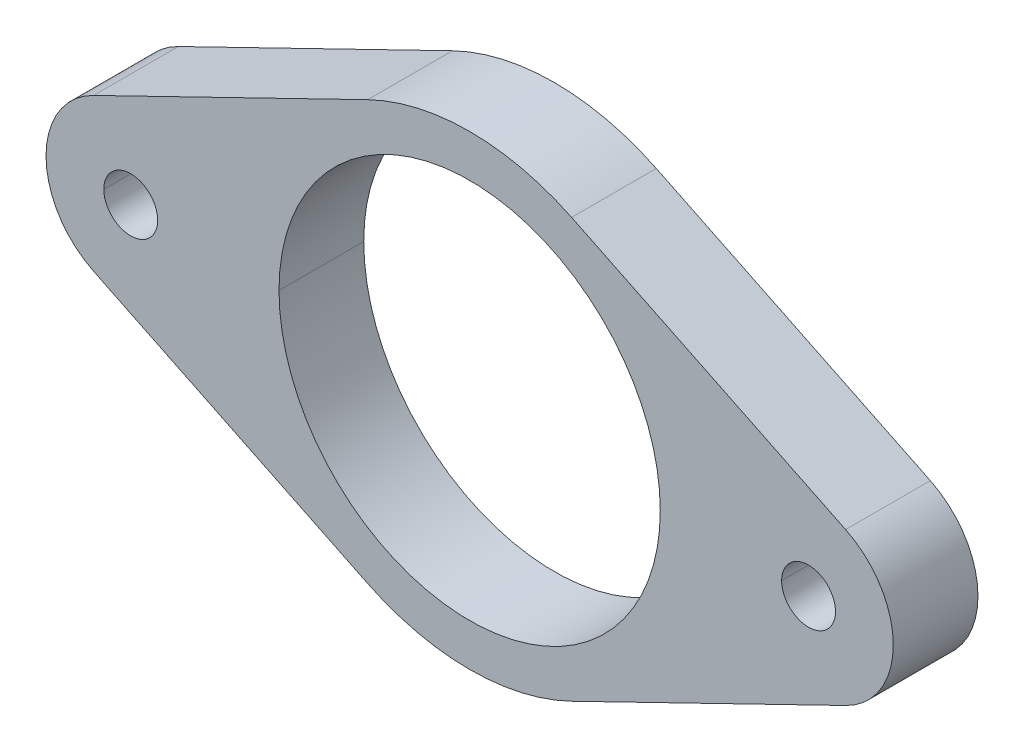
ISO-10303-21;
HEADER;
FILE_DESCRIPTION(('STEP AP214'),'2;1');
FILE_NAME('part.step','',(''),(''),'','','');
FILE_SCHEMA(('AUTOMOTIVE_DESIGN { 1 0 10303 214 1 1 1 1 }'));
ENDSEC;
DATA;
#1=APPLICATION_CONTEXT('core data for automotive mechanical design processes');
#2=APPLICATION_PROTOCOL_DEFINITION('international standard','automotive_design',2000,#1);
#3=PRODUCT_CONTEXT('',#1,'mechanical');
#4=PRODUCT('Part','Part','',(#3));
#5=PRODUCT_RELATED_PRODUCT_CATEGORY('part','',(#4));
#6=PRODUCT_DEFINITION_FORMATION('','',#4);
#7=PRODUCT_DEFINITION_CONTEXT('part definition',#1,'design');
#8=PRODUCT_DEFINITION('design','',#6,#7);
#9=PRODUCT_DEFINITION_SHAPE('','',#8);
#10=(LENGTH_UNIT() NAMED_UNIT(*) SI_UNIT(.MILLI.,.METRE.));
#11=(NAMED_UNIT(*) PLANE_ANGLE_UNIT() SI_UNIT($,.RADIAN.));
#12=(NAMED_UNIT(*) SI_UNIT($,.STERADIAN.) SOLID_ANGLE_UNIT());
#13=UNCERTAINTY_MEASURE_WITH_UNIT(LENGTH_MEASURE(1.E-05),#10,'distance_accuracy_value','');
#14=(GEOMETRIC_REPRESENTATION_CONTEXT(3) GLOBAL_UNCERTAINTY_ASSIGNED_CONTEXT((#13)) GLOBAL_UNIT_ASSIGNED_CONTEXT((#10,
#11,#12)) REPRESENTATION_CONTEXT('',''));
#15=CARTESIAN_POINT('',(0.,0.,0.));
#16=DIRECTION('',(0.,0.,1.));
#17=DIRECTION('',(1.,0.,0.));
#18=AXIS2_PLACEMENT_3D('',#15,#16,#17);
#19=CARTESIAN_POINT('',(-25.4,0.,3.175));
#20=DIRECTION('',(0.,0.,1.));
#21=DIRECTION('',(1.,0.,0.));
#22=AXIS2_PLACEMENT_3D('',#19,#20,#21);
#23=CYLINDRICAL_SURFACE('',#22,2.0193);
#24=DIRECTION('',(0.,0.,1.));
#25=VECTOR('',#24,1.);
#26=CARTESIAN_POINT('',(-27.4193,0.,3.175));
#27=LINE('',#26,#25);
#28=CARTESIAN_POINT('',(-27.4193,0.,-3.175));
#29=VERTEX_POINT('',#28);
#30=CARTESIAN_POINT('',(-27.4193,0.,3.175));
#31=VERTEX_POINT('',#30);
#32=EDGE_CURVE('E269',#29,#31,#27,.T.);
#33=ORIENTED_EDGE('',*,*,#32,.F.);
#34=CARTESIAN_POINT('',(-25.4,0.,-3.175));
#35=DIRECTION('',(0.,0.,1.));
#36=DIRECTION('',(1.,0.,0.));
#37=AXIS2_PLACEMENT_3D('',#34,#35,#36);
#38=CIRCLE('',#37,2.0193);
#39=CARTESIAN_POINT('',(-23.3807,0.,-3.175));
#40=VERTEX_POINT('',#39);
#41=EDGE_CURVE('E28',#40,#29,#38,.T.);
#42=ORIENTED_EDGE('',*,*,#41,.F.);
#43=DIRECTION('',(0.,0.,1.));
#44=VECTOR('',#43,1.);
#45=CARTESIAN_POINT('',(-23.3807,0.,3.175));
#46=LINE('',#45,#44);
#47=CARTESIAN_POINT('',(-23.3807,0.,3.175));
#48=VERTEX_POINT('',#47);
#49=EDGE_CURVE('E264',#40,#48,#46,.T.);
#50=ORIENTED_EDGE('',*,*,#49,.T.);
#51=CARTESIAN_POINT('',(-25.4,0.,3.175));
#52=DIRECTION('',(0.,0.,1.));
#53=DIRECTION('',(1.,0.,0.));
#54=AXIS2_PLACEMENT_3D('',#51,#52,#53);
#55=CIRCLE('',#54,2.0193);
#56=EDGE_CURVE('E245',#48,#31,#55,.T.);
#57=ORIENTED_EDGE('',*,*,#56,.T.);
#58=EDGE_LOOP('',(#33,#42,#50,#57));
#59=FACE_BOUND('',#58,.T.);
#60=ADVANCED_FACE('F17',(#59),#23,.F.);
#61=CARTESIAN_POINT('',(25.4,0.,3.175));
#62=DIRECTION('',(0.,0.,1.));
#63=DIRECTION('',(1.,0.,0.));
#64=AXIS2_PLACEMENT_3D('',#61,#62,#63);
#65=CYLINDRICAL_SURFACE('',#64,2.0193);
#66=DIRECTION('',(0.,0.,1.));
#67=VECTOR('',#66,1.);
#68=CARTESIAN_POINT('',(23.3807,0.,3.175));
#69=LINE('',#68,#67);
#70=CARTESIAN_POINT('',(23.3807,0.,-3.175));
#71=VERTEX_POINT('',#70);
#72=CARTESIAN_POINT('',(23.3807,0.,3.175));
#73=VERTEX_POINT('',#72);
#74=EDGE_CURVE('E263',#71,#73,#69,.T.);
#75=ORIENTED_EDGE('',*,*,#74,.F.);
#76=CARTESIAN_POINT('',(25.4,0.,-3.175));
#77=DIRECTION('',(0.,0.,1.));
#78=DIRECTION('',(1.,0.,0.));
#79=AXIS2_PLACEMENT_3D('',#76,#77,#78);
#80=CIRCLE('',#79,2.0193);
#81=CARTESIAN_POINT('',(27.4193,0.,-3.175));
#82=VERTEX_POINT('',#81);
#83=EDGE_CURVE('E11',#82,#71,#80,.T.);
#84=ORIENTED_EDGE('',*,*,#83,.F.);
#85=DIRECTION('',(0.,0.,1.));
#86=VECTOR('',#85,1.);
#87=CARTESIAN_POINT('',(27.4193,0.,3.175));
#88=LINE('',#87,#86);
#89=CARTESIAN_POINT('',(27.4193,0.,3.175));
#90=VERTEX_POINT('',#89);
#91=EDGE_CURVE('E21',#82,#90,#88,.T.);
#92=ORIENTED_EDGE('',*,*,#91,.T.);
#93=CARTESIAN_POINT('',(25.4,0.,3.175));
#94=DIRECTION('',(0.,0.,1.));
#95=DIRECTION('',(1.,0.,0.));
#96=AXIS2_PLACEMENT_3D('',#93,#94,#95);
#97=CIRCLE('',#96,2.0193);
#98=EDGE_CURVE('E289',#90,#73,#97,.T.);
#99=ORIENTED_EDGE('',*,*,#98,.T.);
#100=EDGE_LOOP('',(#75,#84,#92,#99));
#101=FACE_BOUND('',#100,.T.);
#102=ADVANCED_FACE('F390',(#101),#65,.F.);
#103=CARTESIAN_POINT('',(0.,0.,-3.175));
#104=DIRECTION('',(0.,0.,1.));
#105=DIRECTION('',(1.,0.,0.));
#106=AXIS2_PLACEMENT_3D('',#103,#104,#105);
#107=PLANE('',#106);
#108=CARTESIAN_POINT('',(0.,0.,-3.175));
#109=DIRECTION('',(0.,0.,1.));
#110=DIRECTION('',(1.,0.,0.));
#111=AXIS2_PLACEMENT_3D('',#108,#109,#110);
#112=CIRCLE('',#111,14.2875);
#113=CARTESIAN_POINT('',(-14.2875,0.,-3.175));
#114=VERTEX_POINT('',#113);
#115=CARTESIAN_POINT('',(14.2875,0.,-3.175));
#116=VERTEX_POINT('',#115);
#117=EDGE_CURVE('E194',#114,#116,#112,.T.);
#118=ORIENTED_EDGE('',*,*,#117,.T.);
#119=CARTESIAN_POINT('',(0.,0.,-3.175));
#120=DIRECTION('',(0.,0.,1.));
#121=DIRECTION('',(1.,0.,0.));
#122=AXIS2_PLACEMENT_3D('',#119,#120,#121);
#123=CIRCLE('',#122,14.2875);
#124=EDGE_CURVE('E180',#116,#114,#123,.T.);
#125=ORIENTED_EDGE('',*,*,#124,.T.);
#126=EDGE_LOOP('',(#118,#125));
#127=FACE_BOUND('',#126,.T.);
#128=ORIENTED_EDGE('',*,*,#83,.T.);
#129=CARTESIAN_POINT('',(25.4,0.,-3.175));
#130=DIRECTION('',(0.,0.,1.));
#131=DIRECTION('',(1.,0.,0.));
#132=AXIS2_PLACEMENT_3D('',#129,#130,#131);
#133=CIRCLE('',#132,2.0193);
#134=EDGE_CURVE('E259',#71,#82,#133,.T.);
#135=ORIENTED_EDGE('',*,*,#134,.T.);
#136=EDGE_LOOP('',(#128,#135));
#137=FACE_BOUND('',#136,.T.);
#138=ORIENTED_EDGE('',*,*,#41,.T.);
#139=CARTESIAN_POINT('',(-25.4,0.,-3.175));
#140=DIRECTION('',(0.,0.,1.));
#141=DIRECTION('',(1.,0.,0.));
#142=AXIS2_PLACEMENT_3D('',#139,#140,#141);
#143=CIRCLE('',#142,2.0193);
#144=EDGE_CURVE('E212',#29,#40,#143,.T.);
#145=ORIENTED_EDGE('',*,*,#144,.T.);
#146=EDGE_LOOP('',(#138,#145));
#147=FACE_BOUND('',#146,.T.);
#148=DIRECTION('',(-0.899218410621135,0.4375,0.));
#149=VECTOR('',#148,1.);
#150=CARTESIAN_POINT('',(7.63984375,15.7026014954715,-3.175));
#151=LINE('',#150,#149);
#152=CARTESIAN_POINT('',(28.178125,5.71003690744421,-3.175));
#153=VERTEX_POINT('',#152);
#154=CARTESIAN_POINT('',(7.63984375,15.7026014954715,-3.175));
#155=VERTEX_POINT('',#154);
#156=EDGE_CURVE('E290',#153,#155,#151,.T.);
#157=ORIENTED_EDGE('',*,*,#156,.F.);
#158=CARTESIAN_POINT('',(25.4,0.,-3.175));
#159=DIRECTION('',(0.,0.,1.));
#160=DIRECTION('',(1.,0.,0.));
#161=AXIS2_PLACEMENT_3D('',#158,#159,#160);
#162=CIRCLE('',#161,6.35);
#163=CARTESIAN_POINT('',(28.178125,-5.71003690744421,-3.175));
#164=VERTEX_POINT('',#163);
#165=EDGE_CURVE('E191',#164,#153,#162,.T.);
#166=ORIENTED_EDGE('',*,*,#165,.F.);
#167=DIRECTION('',(-0.899218410621135,-0.4375,0.));
#168=VECTOR('',#167,1.);
#169=CARTESIAN_POINT('',(7.63984375,-15.7026014954715,-3.175));
#170=LINE('',#169,#168);
#171=CARTESIAN_POINT('',(7.63984375,-15.7026014954715,-3.175));
#172=VERTEX_POINT('',#171);
#173=EDGE_CURVE('E355',#164,#172,#170,.T.);
#174=ORIENTED_EDGE('',*,*,#173,.T.);
#175=CARTESIAN_POINT('',(0.,0.,-3.175));
#176=DIRECTION('',(0.,0.,1.));
#177=DIRECTION('',(1.,0.,0.));
#178=AXIS2_PLACEMENT_3D('',#175,#176,#177);
#179=CIRCLE('',#178,17.4625);
#180=CARTESIAN_POINT('',(-7.63984375,-15.7026014954715,-3.175));
#181=VERTEX_POINT('',#180);
#182=EDGE_CURVE('E125',#181,#172,#179,.T.);
#183=ORIENTED_EDGE('',*,*,#182,.F.);
#184=DIRECTION('',(-0.899218410621135,0.4375,0.));
#185=VECTOR('',#184,1.);
#186=CARTESIAN_POINT('',(-7.63984375,-15.7026014954715,-3.175));
#187=LINE('',#186,#185);
#188=CARTESIAN_POINT('',(-28.178125,-5.71003690744421,-3.175));
#189=VERTEX_POINT('',#188);
#190=EDGE_CURVE('E216',#181,#189,#187,.T.);
#191=ORIENTED_EDGE('',*,*,#190,.T.);
#192=CARTESIAN_POINT('',(-25.4,0.,-3.175));
#193=DIRECTION('',(0.,0.,1.));
#194=DIRECTION('',(1.,0.,0.));
#195=AXIS2_PLACEMENT_3D('',#192,#193,#194);
#196=CIRCLE('',#195,6.35);
#197=CARTESIAN_POINT('',(-31.75,0.,-3.175));
#198=VERTEX_POINT('',#197);
#199=EDGE_CURVE('E308',#198,#189,#196,.T.);
#200=ORIENTED_EDGE('',*,*,#199,.F.);
#201=CARTESIAN_POINT('',(-25.4,0.,-3.175));
#202=DIRECTION('',(0.,0.,1.));
#203=DIRECTION('',(1.,0.,0.));
#204=AXIS2_PLACEMENT_3D('',#201,#202,#203);
#205=CIRCLE('',#204,6.35);
#206=CARTESIAN_POINT('',(-28.178125,5.71003690744421,-3.175));
#207=VERTEX_POINT('',#206);
#208=EDGE_CURVE('E214',#207,#198,#205,.T.);
#209=ORIENTED_EDGE('',*,*,#208,.F.);
#210=DIRECTION('',(0.899218410621135,0.4375,0.));
#211=VECTOR('',#210,1.);
#212=CARTESIAN_POINT('',(-7.63984375,15.7026014954715,-3.175));
#213=LINE('',#212,#211);
#214=CARTESIAN_POINT('',(-7.63984375,15.7026014954715,-3.175));
#215=VERTEX_POINT('',#214);
#216=EDGE_CURVE('E218',#207,#215,#213,.T.);
#217=ORIENTED_EDGE('',*,*,#216,.T.);
#218=CARTESIAN_POINT('',(0.,0.,-3.175));
#219=DIRECTION('',(0.,0.,1.));
#220=DIRECTION('',(1.,0.,0.));
#221=AXIS2_PLACEMENT_3D('',#218,#219,#220);
#222=CIRCLE('',#221,17.4625);
#223=EDGE_CURVE('E250',#155,#215,#222,.T.);
#224=ORIENTED_EDGE('',*,*,#223,.F.);
#225=EDGE_LOOP('',(#157,#166,#174,#183,#191,#200,#209,#217,#224));
#226=FACE_BOUND('',#225,.T.);
#227=ADVANCED_FACE('F19',(#127,#137,#147,#226),#107,.F.);
#228=CARTESIAN_POINT('',(0.,0.,3.175));
#229=DIRECTION('',(0.,0.,1.));
#230=DIRECTION('',(1.,0.,0.));
#231=AXIS2_PLACEMENT_3D('',#228,#229,#230);
#232=PLANE('',#231);
#233=CARTESIAN_POINT('',(0.,0.,3.175));
#234=DIRECTION('',(0.,0.,1.));
#235=DIRECTION('',(1.,0.,0.));
#236=AXIS2_PLACEMENT_3D('',#233,#234,#235);
#237=CIRCLE('',#236,14.2875);
#238=CARTESIAN_POINT('',(-14.2875,0.,3.175));
#239=VERTEX_POINT('',#238);
#240=CARTESIAN_POINT('',(14.2875,0.,3.175));
#241=VERTEX_POINT('',#240);
#242=EDGE_CURVE('E201',#239,#241,#237,.T.);
#243=ORIENTED_EDGE('',*,*,#242,.F.);
#244=CARTESIAN_POINT('',(0.,0.,3.175));
#245=DIRECTION('',(0.,0.,1.));
#246=DIRECTION('',(1.,0.,0.));
#247=AXIS2_PLACEMENT_3D('',#244,#245,#246);
#248=CIRCLE('',#247,14.2875);
#249=EDGE_CURVE('E192',#241,#239,#248,.T.);
#250=ORIENTED_EDGE('',*,*,#249,.F.);
#251=EDGE_LOOP('',(#243,#250));
#252=FACE_BOUND('',#251,.T.);
#253=ORIENTED_EDGE('',*,*,#98,.F.);
#254=CARTESIAN_POINT('',(25.4,0.,3.175));
#255=DIRECTION('',(0.,0.,1.));
#256=DIRECTION('',(1.,0.,0.));
#257=AXIS2_PLACEMENT_3D('',#254,#255,#256);
#258=CIRCLE('',#257,2.0193);
#259=EDGE_CURVE('E303',#73,#90,#258,.T.);
#260=ORIENTED_EDGE('',*,*,#259,.F.);
#261=EDGE_LOOP('',(#253,#260));
#262=FACE_BOUND('',#261,.T.);
#263=ORIENTED_EDGE('',*,*,#56,.F.);
#264=CARTESIAN_POINT('',(-25.4,0.,3.175));
#265=DIRECTION('',(0.,0.,1.));
#266=DIRECTION('',(1.,0.,0.));
#267=AXIS2_PLACEMENT_3D('',#264,#265,#266);
#268=CIRCLE('',#267,2.0193);
#269=EDGE_CURVE('E265',#31,#48,#268,.T.);
#270=ORIENTED_EDGE('',*,*,#269,.F.);
#271=EDGE_LOOP('',(#263,#270));
#272=FACE_BOUND('',#271,.T.);
#273=DIRECTION('',(-0.899218410621135,0.4375,0.));
#274=VECTOR('',#273,1.);
#275=CARTESIAN_POINT('',(7.63984375,15.7026014954715,3.175));
#276=LINE('',#275,#274);
#277=CARTESIAN_POINT('',(28.178125,5.71003690744421,3.175));
#278=VERTEX_POINT('',#277);
#279=CARTESIAN_POINT('',(7.63984375,15.7026014954715,3.175));
#280=VERTEX_POINT('',#279);
#281=EDGE_CURVE('E270',#278,#280,#276,.T.);
#282=ORIENTED_EDGE('',*,*,#281,.T.);
#283=CARTESIAN_POINT('',(0.,0.,3.175));
#284=DIRECTION('',(0.,0.,1.));
#285=DIRECTION('',(1.,0.,0.));
#286=AXIS2_PLACEMENT_3D('',#283,#284,#285);
#287=CIRCLE('',#286,17.4625);
#288=CARTESIAN_POINT('',(-7.63984375,15.7026014954715,3.175));
#289=VERTEX_POINT('',#288);
#290=EDGE_CURVE('E221',#280,#289,#287,.T.);
#291=ORIENTED_EDGE('',*,*,#290,.T.);
#292=DIRECTION('',(0.899218410621135,0.4375,0.));
#293=VECTOR('',#292,1.);
#294=CARTESIAN_POINT('',(-7.63984375,15.7026014954715,3.175));
#295=LINE('',#294,#293);
#296=CARTESIAN_POINT('',(-28.178125,5.71003690744421,3.175));
#297=VERTEX_POINT('',#296);
#298=EDGE_CURVE('E224',#297,#289,#295,.T.);
#299=ORIENTED_EDGE('',*,*,#298,.F.);
#300=CARTESIAN_POINT('',(-25.4,0.,3.175));
#301=DIRECTION('',(0.,0.,1.));
#302=DIRECTION('',(1.,0.,0.));
#303=AXIS2_PLACEMENT_3D('',#300,#301,#302);
#304=CIRCLE('',#303,6.35);
#305=CARTESIAN_POINT('',(-31.75,0.,3.175));
#306=VERTEX_POINT('',#305);
#307=EDGE_CURVE('E217',#297,#306,#304,.T.);
#308=ORIENTED_EDGE('',*,*,#307,.T.);
#309=CARTESIAN_POINT('',(-25.4,0.,3.175));
#310=DIRECTION('',(0.,0.,1.));
#311=DIRECTION('',(1.,0.,0.));
#312=AXIS2_PLACEMENT_3D('',#309,#310,#311);
#313=CIRCLE('',#312,6.35);
#314=CARTESIAN_POINT('',(-28.178125,-5.71003690744421,3.175));
#315=VERTEX_POINT('',#314);
#316=EDGE_CURVE('E258',#306,#315,#313,.T.);
#317=ORIENTED_EDGE('',*,*,#316,.T.);
#318=DIRECTION('',(-0.899218410621135,0.4375,0.));
#319=VECTOR('',#318,1.);
#320=CARTESIAN_POINT('',(-7.63984375,-15.7026014954715,3.175));
#321=LINE('',#320,#319);
#322=CARTESIAN_POINT('',(-7.63984375,-15.7026014954715,3.175));
#323=VERTEX_POINT('',#322);
#324=EDGE_CURVE('E249',#323,#315,#321,.T.);
#325=ORIENTED_EDGE('',*,*,#324,.F.);
#326=CARTESIAN_POINT('',(0.,0.,3.175));
#327=DIRECTION('',(0.,0.,1.));
#328=DIRECTION('',(1.,0.,0.));
#329=AXIS2_PLACEMENT_3D('',#326,#327,#328);
#330=CIRCLE('',#329,17.4625);
#331=CARTESIAN_POINT('',(7.63984375,-15.7026014954715,3.175));
#332=VERTEX_POINT('',#331);
#333=EDGE_CURVE('E134',#323,#332,#330,.T.);
#334=ORIENTED_EDGE('',*,*,#333,.T.);
#335=DIRECTION('',(-0.899218410621135,-0.4375,0.));
#336=VECTOR('',#335,1.);
#337=CARTESIAN_POINT('',(7.63984375,-15.7026014954715,3.175));
#338=LINE('',#337,#336);
#339=CARTESIAN_POINT('',(28.178125,-5.71003690744421,3.175));
#340=VERTEX_POINT('',#339);
#341=EDGE_CURVE('E278',#340,#332,#338,.T.);
#342=ORIENTED_EDGE('',*,*,#341,.F.);
#343=CARTESIAN_POINT('',(25.4,0.,3.175));
#344=DIRECTION('',(0.,0.,1.));
#345=DIRECTION('',(1.,0.,0.));
#346=AXIS2_PLACEMENT_3D('',#343,#344,#345);
#347=CIRCLE('',#346,6.35);
#348=EDGE_CURVE('E43',#340,#278,#347,.T.);
#349=ORIENTED_EDGE('',*,*,#348,.T.);
#350=EDGE_LOOP('',(#282,#291,#299,#308,#317,#325,#334,#342,#349));
#351=FACE_BOUND('',#350,.T.);
#352=ADVANCED_FACE('F324',(#252,#262,#272,#351),#232,.T.);
#353=CARTESIAN_POINT('',(25.4,0.,3.175));
#354=DIRECTION('',(0.,0.,-1.));
#355=DIRECTION('',(-1.,0.,0.));
#356=AXIS2_PLACEMENT_3D('',#353,#354,#355);
#357=CYLINDRICAL_SURFACE('',#356,6.35);
#358=ORIENTED_EDGE('',*,*,#165,.T.);
#359=DIRECTION('',(0.,0.,-1.));
#360=VECTOR('',#359,1.);
#361=CARTESIAN_POINT('',(28.178125,5.71003690744421,3.175));
#362=LINE('',#361,#360);
#363=EDGE_CURVE('E255',#278,#153,#362,.T.);
#364=ORIENTED_EDGE('',*,*,#363,.F.);
#365=ORIENTED_EDGE('',*,*,#348,.F.);
#366=DIRECTION('',(0.,0.,-1.));
#367=VECTOR('',#366,1.);
#368=CARTESIAN_POINT('',(28.178125,-5.71003690744421,3.175));
#369=LINE('',#368,#367);
#370=EDGE_CURVE('E281',#340,#164,#369,.T.);
#371=ORIENTED_EDGE('',*,*,#370,.T.);
#372=EDGE_LOOP('',(#358,#364,#365,#371));
#373=FACE_BOUND('',#372,.T.);
#374=ADVANCED_FACE('F327',(#373),#357,.T.);
#375=CARTESIAN_POINT('',(0.,0.,3.175));
#376=DIRECTION('',(0.,0.,-1.));
#377=DIRECTION('',(-1.,0.,0.));
#378=AXIS2_PLACEMENT_3D('',#375,#376,#377);
#379=CYLINDRICAL_SURFACE('',#378,14.2875);
#380=DIRECTION('',(0.,0.,-1.));
#381=VECTOR('',#380,1.);
#382=CARTESIAN_POINT('',(14.2875,0.,3.175));
#383=LINE('',#382,#381);
#384=EDGE_CURVE('E184',#241,#116,#383,.T.);
#385=ORIENTED_EDGE('',*,*,#384,.F.);
#386=ORIENTED_EDGE('',*,*,#249,.T.);
#387=DIRECTION('',(0.,0.,-1.));
#388=VECTOR('',#387,1.);
#389=CARTESIAN_POINT('',(-14.2875,0.,3.175));
#390=LINE('',#389,#388);
#391=EDGE_CURVE('E187',#239,#114,#390,.T.);
#392=ORIENTED_EDGE('',*,*,#391,.T.);
#393=ORIENTED_EDGE('',*,*,#124,.F.);
#394=EDGE_LOOP('',(#385,#386,#392,#393));
#395=FACE_BOUND('',#394,.T.);
#396=ADVANCED_FACE('F182',(#395),#379,.F.);
#397=CARTESIAN_POINT('',(7.63984375,-15.7026014954715,3.175));
#398=DIRECTION('',(0.4375,-0.899218410621135,0.));
#399=DIRECTION('',(0.,0.,-1.));
#400=AXIS2_PLACEMENT_3D('',#397,#398,#399);
#401=PLANE('',#400);
#402=ORIENTED_EDGE('',*,*,#173,.F.);
#403=ORIENTED_EDGE('',*,*,#370,.F.);
#404=ORIENTED_EDGE('',*,*,#341,.T.);
#405=DIRECTION('',(0.,0.,-1.));
#406=VECTOR('',#405,1.);
#407=CARTESIAN_POINT('',(7.63984375,-15.7026014954715,3.175));
#408=LINE('',#407,#406);
#409=EDGE_CURVE('E286',#332,#172,#408,.T.);
#410=ORIENTED_EDGE('',*,*,#409,.T.);
#411=EDGE_LOOP('',(#402,#403,#404,#410));
#412=FACE_BOUND('',#411,.T.);
#413=ADVANCED_FACE('F405',(#412),#401,.T.);
#414=CARTESIAN_POINT('',(0.,0.,3.175));
#415=DIRECTION('',(0.,0.,-1.));
#416=DIRECTION('',(-1.,0.,0.));
#417=AXIS2_PLACEMENT_3D('',#414,#415,#416);
#418=CYLINDRICAL_SURFACE('',#417,17.4625);
#419=ORIENTED_EDGE('',*,*,#182,.T.);
#420=ORIENTED_EDGE('',*,*,#409,.F.);
#421=ORIENTED_EDGE('',*,*,#333,.F.);
#422=DIRECTION('',(0.,0.,-1.));
#423=VECTOR('',#422,1.);
#424=CARTESIAN_POINT('',(-7.63984375,-15.7026014954715,3.175));
#425=LINE('',#424,#423);
#426=EDGE_CURVE('E247',#323,#181,#425,.T.);
#427=ORIENTED_EDGE('',*,*,#426,.T.);
#428=EDGE_LOOP('',(#419,#420,#421,#427));
#429=FACE_BOUND('',#428,.T.);
#430=ADVANCED_FACE('F398',(#429),#418,.T.);
#431=CARTESIAN_POINT('',(-7.63984375,-15.7026014954715,3.175));
#432=DIRECTION('',(-0.4375,-0.899218410621135,0.));
#433=DIRECTION('',(-0.899218410621135,0.4375,0.));
#434=AXIS2_PLACEMENT_3D('',#431,#432,#433);
#435=PLANE('',#434);
#436=ORIENTED_EDGE('',*,*,#190,.F.);
#437=ORIENTED_EDGE('',*,*,#426,.F.);
#438=ORIENTED_EDGE('',*,*,#324,.T.);
#439=DIRECTION('',(0.,0.,-1.));
#440=VECTOR('',#439,1.);
#441=CARTESIAN_POINT('',(-28.178125,-5.71003690744421,3.175));
#442=LINE('',#441,#440);
#443=EDGE_CURVE('E294',#315,#189,#442,.T.);
#444=ORIENTED_EDGE('',*,*,#443,.T.);
#445=EDGE_LOOP('',(#436,#437,#438,#444));
#446=FACE_BOUND('',#445,.T.);
#447=ADVANCED_FACE('F387',(#446),#435,.T.);
#448=CARTESIAN_POINT('',(-25.4,0.,3.175));
#449=DIRECTION('',(0.,0.,-1.));
#450=DIRECTION('',(-1.,0.,0.));
#451=AXIS2_PLACEMENT_3D('',#448,#449,#450);
#452=CYLINDRICAL_SURFACE('',#451,6.35);
#453=DIRECTION('',(0.,0.,-1.));
#454=VECTOR('',#453,1.);
#455=CARTESIAN_POINT('',(-31.75,0.,3.175));
#456=LINE('',#455,#454);
#457=EDGE_CURVE('E307',#306,#198,#456,.T.);
#458=ORIENTED_EDGE('',*,*,#457,.F.);
#459=ORIENTED_EDGE('',*,*,#307,.F.);
#460=DIRECTION('',(0.,0.,-1.));
#461=VECTOR('',#460,1.);
#462=CARTESIAN_POINT('',(-28.178125,5.71003690744421,3.175));
#463=LINE('',#462,#461);
#464=EDGE_CURVE('E220',#297,#207,#463,.T.);
#465=ORIENTED_EDGE('',*,*,#464,.T.);
#466=ORIENTED_EDGE('',*,*,#208,.T.);
#467=EDGE_LOOP('',(#458,#459,#465,#466));
#468=FACE_BOUND('',#467,.T.);
#469=ADVANCED_FACE('F379',(#468),#452,.T.);
#470=CARTESIAN_POINT('',(-7.63984375,15.7026014954715,3.175));
#471=DIRECTION('',(-0.4375,0.899218410621135,0.));
#472=DIRECTION('',(0.,0.,1.));
#473=AXIS2_PLACEMENT_3D('',#470,#471,#472);
#474=PLANE('',#473);
#475=ORIENTED_EDGE('',*,*,#216,.F.);
#476=ORIENTED_EDGE('',*,*,#464,.F.);
#477=ORIENTED_EDGE('',*,*,#298,.T.);
#478=DIRECTION('',(0.,0.,-1.));
#479=VECTOR('',#478,1.);
#480=CARTESIAN_POINT('',(-7.63984375,15.7026014954715,3.175));
#481=LINE('',#480,#479);
#482=EDGE_CURVE('E254',#289,#215,#481,.T.);
#483=ORIENTED_EDGE('',*,*,#482,.T.);
#484=EDGE_LOOP('',(#475,#476,#477,#483));
#485=FACE_BOUND('',#484,.T.);
#486=ADVANCED_FACE('F377',(#485),#474,.T.);
#487=CARTESIAN_POINT('',(0.,0.,3.175));
#488=DIRECTION('',(0.,0.,-1.));
#489=DIRECTION('',(-1.,0.,0.));
#490=AXIS2_PLACEMENT_3D('',#487,#488,#489);
#491=CYLINDRICAL_SURFACE('',#490,17.4625);
#492=ORIENTED_EDGE('',*,*,#223,.T.);
#493=ORIENTED_EDGE('',*,*,#482,.F.);
#494=ORIENTED_EDGE('',*,*,#290,.F.);
#495=DIRECTION('',(0.,0.,-1.));
#496=VECTOR('',#495,1.);
#497=CARTESIAN_POINT('',(7.63984375,15.7026014954715,3.175));
#498=LINE('',#497,#496);
#499=EDGE_CURVE('E274',#280,#155,#498,.T.);
#500=ORIENTED_EDGE('',*,*,#499,.T.);
#501=EDGE_LOOP('',(#492,#493,#494,#500));
#502=FACE_BOUND('',#501,.T.);
#503=ADVANCED_FACE('F343',(#502),#491,.T.);
#504=CARTESIAN_POINT('',(7.63984375,15.7026014954715,3.175));
#505=DIRECTION('',(-0.4375,-0.899218410621135,0.));
#506=DIRECTION('',(-0.899218410621135,0.4375,0.));
#507=AXIS2_PLACEMENT_3D('',#504,#505,#506);
#508=PLANE('',#507);
#509=ORIENTED_EDGE('',*,*,#156,.T.);
#510=ORIENTED_EDGE('',*,*,#499,.F.);
#511=ORIENTED_EDGE('',*,*,#281,.F.);
#512=ORIENTED_EDGE('',*,*,#363,.T.);
#513=EDGE_LOOP('',(#509,#510,#511,#512));
#514=FACE_BOUND('',#513,.T.);
#515=ADVANCED_FACE('F340',(#514),#508,.F.);
#516=CARTESIAN_POINT('',(-25.4,0.,3.175));
#517=DIRECTION('',(0.,0.,-1.));
#518=DIRECTION('',(-1.,0.,0.));
#519=AXIS2_PLACEMENT_3D('',#516,#517,#518);
#520=CYLINDRICAL_SURFACE('',#519,6.35);
#521=ORIENTED_EDGE('',*,*,#316,.F.);
#522=ORIENTED_EDGE('',*,*,#457,.T.);
#523=ORIENTED_EDGE('',*,*,#199,.T.);
#524=ORIENTED_EDGE('',*,*,#443,.F.);
#525=EDGE_LOOP('',(#521,#522,#523,#524));
#526=FACE_BOUND('',#525,.T.);
#527=ADVANCED_FACE('F412',(#526),#520,.T.);
#528=CARTESIAN_POINT('',(0.,0.,3.175));
#529=DIRECTION('',(0.,0.,-1.));
#530=DIRECTION('',(-1.,0.,0.));
#531=AXIS2_PLACEMENT_3D('',#528,#529,#530);
#532=CYLINDRICAL_SURFACE('',#531,14.2875);
#533=ORIENTED_EDGE('',*,*,#242,.T.);
#534=ORIENTED_EDGE('',*,*,#384,.T.);
#535=ORIENTED_EDGE('',*,*,#117,.F.);
#536=ORIENTED_EDGE('',*,*,#391,.F.);
#537=EDGE_LOOP('',(#533,#534,#535,#536));
#538=FACE_BOUND('',#537,.T.);
#539=ADVANCED_FACE('F199',(#538),#532,.F.);
#540=CARTESIAN_POINT('',(25.4,0.,3.175));
#541=DIRECTION('',(0.,0.,1.));
#542=DIRECTION('',(1.,0.,0.));
#543=AXIS2_PLACEMENT_3D('',#540,#541,#542);
#544=CYLINDRICAL_SURFACE('',#543,2.0193);
#545=ORIENTED_EDGE('',*,*,#134,.F.);
#546=ORIENTED_EDGE('',*,*,#74,.T.);
#547=ORIENTED_EDGE('',*,*,#259,.T.);
#548=ORIENTED_EDGE('',*,*,#91,.F.);
#549=EDGE_LOOP('',(#545,#546,#547,#548));
#550=FACE_BOUND('',#549,.T.);
#551=ADVANCED_FACE('F425',(#550),#544,.F.);
#552=CARTESIAN_POINT('',(-25.4,0.,3.175));
#553=DIRECTION('',(0.,0.,1.));
#554=DIRECTION('',(1.,0.,0.));
#555=AXIS2_PLACEMENT_3D('',#552,#553,#554);
#556=CYLINDRICAL_SURFACE('',#555,2.0193);
#557=ORIENTED_EDGE('',*,*,#144,.F.);
#558=ORIENTED_EDGE('',*,*,#32,.T.);
#559=ORIENTED_EDGE('',*,*,#269,.T.);
#560=ORIENTED_EDGE('',*,*,#49,.F.);
#561=EDGE_LOOP('',(#557,#558,#559,#560));
#562=FACE_BOUND('',#561,.T.);
#563=ADVANCED_FACE('F430',(#562),#556,.F.);
#564=CLOSED_SHELL('',(#60,#102,#227,#352,#374,#396,#413,#430,#447,#469,#486,#503,#515,#527,#539,
#551,#563));
#565=MANIFOLD_SOLID_BREP('B1',#564);
#566=ADVANCED_BREP_SHAPE_REPRESENTATION('',(#18,#565),#14);
#567=SHAPE_DEFINITION_REPRESENTATION(#9,#566);
ENDSEC;
END-ISO-10303-21;
